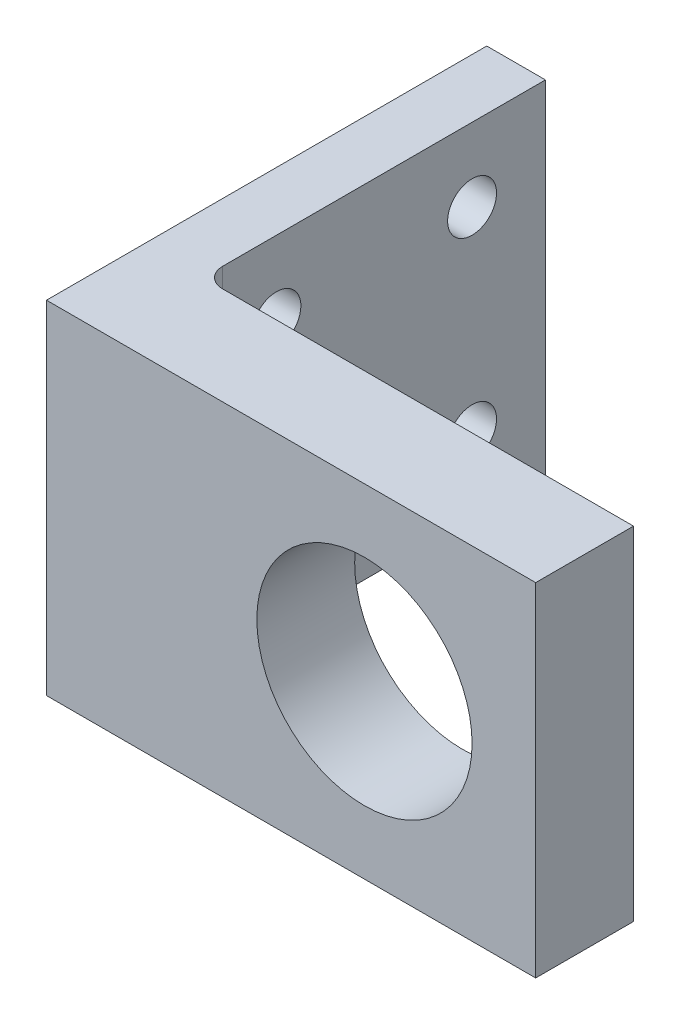
ISO-10303-21;
HEADER;
FILE_DESCRIPTION(('STEP AP214'),'2;1');
FILE_NAME('part.step','',(''),(''),'','','');
FILE_SCHEMA(('AUTOMOTIVE_DESIGN { 1 0 10303 214 1 1 1 1 }'));
ENDSEC;
DATA;
#1=APPLICATION_CONTEXT('core data for automotive mechanical design processes');
#2=APPLICATION_PROTOCOL_DEFINITION('international standard','automotive_design',2000,#1);
#3=PRODUCT_CONTEXT('',#1,'mechanical');
#4=PRODUCT('Part','Part','',(#3));
#5=PRODUCT_RELATED_PRODUCT_CATEGORY('part','',(#4));
#6=PRODUCT_DEFINITION_FORMATION('','',#4);
#7=PRODUCT_DEFINITION_CONTEXT('part definition',#1,'design');
#8=PRODUCT_DEFINITION('design','',#6,#7);
#9=PRODUCT_DEFINITION_SHAPE('','',#8);
#10=(LENGTH_UNIT() NAMED_UNIT(*) SI_UNIT(.MILLI.,.METRE.));
#11=(NAMED_UNIT(*) PLANE_ANGLE_UNIT() SI_UNIT($,.RADIAN.));
#12=(NAMED_UNIT(*) SI_UNIT($,.STERADIAN.) SOLID_ANGLE_UNIT());
#13=UNCERTAINTY_MEASURE_WITH_UNIT(LENGTH_MEASURE(1.E-05),#10,'distance_accuracy_value','');
#14=(GEOMETRIC_REPRESENTATION_CONTEXT(3) GLOBAL_UNCERTAINTY_ASSIGNED_CONTEXT((#13)) GLOBAL_UNIT_ASSIGNED_CONTEXT((#10,
#11,#12)) REPRESENTATION_CONTEXT('',''));
#15=CARTESIAN_POINT('',(0.,0.,0.));
#16=DIRECTION('',(0.,0.,1.));
#17=DIRECTION('',(1.,0.,0.));
#18=AXIS2_PLACEMENT_3D('',#15,#16,#17);
#19=CARTESIAN_POINT('',(7.99999999999999,0.,-2.));
#20=DIRECTION('',(0.,1.,0.));
#21=DIRECTION('',(-1.,0.,0.));
#22=AXIS2_PLACEMENT_3D('',#19,#20,#21);
#23=CYLINDRICAL_SURFACE('',#22,2.);
#24=DIRECTION('',(0.,1.,0.));
#25=VECTOR('',#24,1.);
#26=CARTESIAN_POINT('',(7.99999999999999,0.,0.));
#27=LINE('',#26,#25);
#28=CARTESIAN_POINT('',(7.99999999999999,0.,0.));
#29=VERTEX_POINT('',#28);
#30=CARTESIAN_POINT('',(7.99999999999999,35.,0.));
#31=VERTEX_POINT('',#30);
#32=EDGE_CURVE('E149',#29,#31,#27,.T.);
#33=ORIENTED_EDGE('',*,*,#32,.F.);
#34=CARTESIAN_POINT('',(7.99999999999999,0.,-2.));
#35=DIRECTION('',(0.,1.,0.));
#36=DIRECTION('',(0.,0.,1.));
#37=AXIS2_PLACEMENT_3D('',#34,#35,#36);
#38=CIRCLE('',#37,2.);
#39=CARTESIAN_POINT('',(5.99999999999999,0.,-2.));
#40=VERTEX_POINT('',#39);
#41=EDGE_CURVE('E42',#29,#40,#38,.F.);
#42=ORIENTED_EDGE('',*,*,#41,.T.);
#43=DIRECTION('',(0.,1.,0.));
#44=VECTOR('',#43,1.);
#45=CARTESIAN_POINT('',(5.99999999999999,0.,-2.));
#46=LINE('',#45,#44);
#47=CARTESIAN_POINT('',(5.99999999999999,35.,-2.));
#48=VERTEX_POINT('',#47);
#49=EDGE_CURVE('E113',#48,#40,#46,.F.);
#50=ORIENTED_EDGE('',*,*,#49,.F.);
#51=CARTESIAN_POINT('',(7.99999999999999,35.,-2.));
#52=DIRECTION('',(0.,-1.,0.));
#53=DIRECTION('',(1.,0.,0.));
#54=AXIS2_PLACEMENT_3D('',#51,#52,#53);
#55=CIRCLE('',#54,2.);
#56=EDGE_CURVE('E11',#48,#31,#55,.F.);
#57=ORIENTED_EDGE('',*,*,#56,.T.);
#58=EDGE_LOOP('',(#33,#42,#50,#57));
#59=FACE_BOUND('',#58,.T.);
#60=ADVANCED_FACE('F35',(#59),#23,.F.);
#61=CARTESIAN_POINT('',(0.,0.,10.));
#62=DIRECTION('',(0.,0.,-1.));
#63=DIRECTION('',(-1.,0.,0.));
#64=AXIS2_PLACEMENT_3D('',#61,#62,#63);
#65=PLANE('',#64);
#66=DIRECTION('',(0.,-1.,0.));
#67=VECTOR('',#66,1.);
#68=CARTESIAN_POINT('',(0.,0.,10.));
#69=LINE('',#68,#67);
#70=CARTESIAN_POINT('',(0.,35.,10.));
#71=VERTEX_POINT('',#70);
#72=CARTESIAN_POINT('',(0.,0.,10.));
#73=VERTEX_POINT('',#72);
#74=EDGE_CURVE('E126',#71,#73,#69,.T.);
#75=ORIENTED_EDGE('',*,*,#74,.T.);
#76=DIRECTION('',(1.,0.,0.));
#77=VECTOR('',#76,1.);
#78=CARTESIAN_POINT('',(0.,0.,10.));
#79=LINE('',#78,#77);
#80=CARTESIAN_POINT('',(50.,0.,10.));
#81=VERTEX_POINT('',#80);
#82=EDGE_CURVE('E129',#73,#81,#79,.T.);
#83=ORIENTED_EDGE('',*,*,#82,.T.);
#84=DIRECTION('',(0.,1.,0.));
#85=VECTOR('',#84,1.);
#86=CARTESIAN_POINT('',(50.,0.,10.));
#87=LINE('',#86,#85);
#88=CARTESIAN_POINT('',(50.,35.,10.));
#89=VERTEX_POINT('',#88);
#90=EDGE_CURVE('E132',#81,#89,#87,.T.);
#91=ORIENTED_EDGE('',*,*,#90,.T.);
#92=DIRECTION('',(-1.,0.,0.));
#93=VECTOR('',#92,1.);
#94=CARTESIAN_POINT('',(0.,35.,10.));
#95=LINE('',#94,#93);
#96=EDGE_CURVE('E134',#89,#71,#95,.T.);
#97=ORIENTED_EDGE('',*,*,#96,.T.);
#98=EDGE_LOOP('',(#75,#83,#91,#97));
#99=FACE_BOUND('',#98,.T.);
#100=CARTESIAN_POINT('',(32.5,17.5,10.));
#101=DIRECTION('',(0.,0.,1.));
#102=DIRECTION('',(1.,0.,0.));
#103=AXIS2_PLACEMENT_3D('',#100,#101,#102);
#104=CIRCLE('',#103,11.);
#105=CARTESIAN_POINT('',(43.5,17.5,10.));
#106=VERTEX_POINT('',#105);
#107=EDGE_CURVE('E118',#106,#106,#104,.T.);
#108=ORIENTED_EDGE('',*,*,#107,.F.);
#109=EDGE_LOOP('',(#108));
#110=FACE_BOUND('',#109,.T.);
#111=ADVANCED_FACE('F168',(#99,#110),#65,.F.);
#112=CARTESIAN_POINT('',(0.,0.,0.));
#113=DIRECTION('',(0.,0.,-1.));
#114=DIRECTION('',(-1.,0.,0.));
#115=AXIS2_PLACEMENT_3D('',#112,#113,#114);
#116=PLANE('',#115);
#117=DIRECTION('',(1.,0.,0.));
#118=VECTOR('',#117,1.);
#119=CARTESIAN_POINT('',(0.,0.,0.));
#120=LINE('',#119,#118);
#121=CARTESIAN_POINT('',(50.,0.,0.));
#122=VERTEX_POINT('',#121);
#123=EDGE_CURVE('E124',#29,#122,#120,.T.);
#124=ORIENTED_EDGE('',*,*,#123,.F.);
#125=ORIENTED_EDGE('',*,*,#32,.T.);
#126=DIRECTION('',(-1.,0.,0.));
#127=VECTOR('',#126,1.);
#128=CARTESIAN_POINT('',(0.,35.,0.));
#129=LINE('',#128,#127);
#130=CARTESIAN_POINT('',(50.,35.,0.));
#131=VERTEX_POINT('',#130);
#132=EDGE_CURVE('E130',#131,#31,#129,.T.);
#133=ORIENTED_EDGE('',*,*,#132,.F.);
#134=DIRECTION('',(0.,1.,0.));
#135=VECTOR('',#134,1.);
#136=CARTESIAN_POINT('',(50.,0.,0.));
#137=LINE('',#136,#135);
#138=EDGE_CURVE('E138',#122,#131,#137,.T.);
#139=ORIENTED_EDGE('',*,*,#138,.F.);
#140=EDGE_LOOP('',(#124,#125,#133,#139));
#141=FACE_BOUND('',#140,.T.);
#142=CARTESIAN_POINT('',(32.5,17.5,0.));
#143=DIRECTION('',(0.,0.,1.));
#144=DIRECTION('',(1.,0.,0.));
#145=AXIS2_PLACEMENT_3D('',#142,#143,#144);
#146=CIRCLE('',#145,11.);
#147=CARTESIAN_POINT('',(43.5,17.5,0.));
#148=VERTEX_POINT('',#147);
#149=EDGE_CURVE('E114',#148,#148,#146,.T.);
#150=ORIENTED_EDGE('',*,*,#149,.T.);
#151=EDGE_LOOP('',(#150));
#152=FACE_BOUND('',#151,.T.);
#153=ADVANCED_FACE('F155',(#141,#152),#116,.T.);
#154=CARTESIAN_POINT('',(0.,0.,10.));
#155=DIRECTION('',(1.,0.,0.));
#156=DIRECTION('',(0.,1.,0.));
#157=AXIS2_PLACEMENT_3D('',#154,#155,#156);
#158=PLANE('',#157);
#159=CARTESIAN_POINT('',(0.,27.5,-27.5));
#160=DIRECTION('',(1.,0.,0.));
#161=DIRECTION('',(0.,1.,0.));
#162=AXIS2_PLACEMENT_3D('',#159,#160,#161);
#163=CIRCLE('',#162,2.5);
#164=CARTESIAN_POINT('',(0.,30.,-27.5));
#165=VERTEX_POINT('',#164);
#166=EDGE_CURVE('E110',#165,#165,#163,.T.);
#167=ORIENTED_EDGE('',*,*,#166,.T.);
#168=EDGE_LOOP('',(#167));
#169=FACE_BOUND('',#168,.T.);
#170=CARTESIAN_POINT('',(0.,7.5,-7.5));
#171=DIRECTION('',(1.,0.,0.));
#172=DIRECTION('',(0.,1.,0.));
#173=AXIS2_PLACEMENT_3D('',#170,#171,#172);
#174=CIRCLE('',#173,2.5);
#175=CARTESIAN_POINT('',(0.,10.,-7.5));
#176=VERTEX_POINT('',#175);
#177=EDGE_CURVE('E176',#176,#176,#174,.T.);
#178=ORIENTED_EDGE('',*,*,#177,.T.);
#179=EDGE_LOOP('',(#178));
#180=FACE_BOUND('',#179,.T.);
#181=CARTESIAN_POINT('',(0.,7.5,-27.5));
#182=DIRECTION('',(1.,0.,0.));
#183=DIRECTION('',(0.,1.,0.));
#184=AXIS2_PLACEMENT_3D('',#181,#182,#183);
#185=CIRCLE('',#184,2.5);
#186=CARTESIAN_POINT('',(0.,10.,-27.5));
#187=VERTEX_POINT('',#186);
#188=EDGE_CURVE('E179',#187,#187,#185,.T.);
#189=ORIENTED_EDGE('',*,*,#188,.T.);
#190=EDGE_LOOP('',(#189));
#191=FACE_BOUND('',#190,.T.);
#192=CARTESIAN_POINT('',(0.,27.5,-7.5));
#193=DIRECTION('',(1.,0.,0.));
#194=DIRECTION('',(0.,1.,0.));
#195=AXIS2_PLACEMENT_3D('',#192,#193,#194);
#196=CIRCLE('',#195,2.5);
#197=CARTESIAN_POINT('',(0.,30.,-7.5));
#198=VERTEX_POINT('',#197);
#199=EDGE_CURVE('E182',#198,#198,#196,.T.);
#200=ORIENTED_EDGE('',*,*,#199,.T.);
#201=EDGE_LOOP('',(#200));
#202=FACE_BOUND('',#201,.T.);
#203=DIRECTION('',(0.,0.,-1.));
#204=VECTOR('',#203,1.);
#205=CARTESIAN_POINT('',(0.,35.,10.));
#206=LINE('',#205,#204);
#207=CARTESIAN_POINT('',(0.,35.,-35.));
#208=VERTEX_POINT('',#207);
#209=EDGE_CURVE('E136',#71,#208,#206,.T.);
#210=ORIENTED_EDGE('',*,*,#209,.T.);
#211=DIRECTION('',(0.,1.,0.));
#212=VECTOR('',#211,1.);
#213=CARTESIAN_POINT('',(0.,0.,-35.));
#214=LINE('',#213,#212);
#215=CARTESIAN_POINT('',(0.,0.,-35.));
#216=VERTEX_POINT('',#215);
#217=EDGE_CURVE('E101',#216,#208,#214,.T.);
#218=ORIENTED_EDGE('',*,*,#217,.F.);
#219=DIRECTION('',(0.,0.,-1.));
#220=VECTOR('',#219,1.);
#221=CARTESIAN_POINT('',(0.,0.,10.));
#222=LINE('',#221,#220);
#223=EDGE_CURVE('E97',#73,#216,#222,.T.);
#224=ORIENTED_EDGE('',*,*,#223,.F.);
#225=ORIENTED_EDGE('',*,*,#74,.F.);
#226=EDGE_LOOP('',(#210,#218,#224,#225));
#227=FACE_BOUND('',#226,.T.);
#228=ADVANCED_FACE('F171',(#169,#180,#191,#202,#227),#158,.F.);
#229=CARTESIAN_POINT('',(0.,0.,10.));
#230=DIRECTION('',(0.,1.,0.));
#231=DIRECTION('',(0.,0.,1.));
#232=AXIS2_PLACEMENT_3D('',#229,#230,#231);
#233=PLANE('',#232);
#234=ORIENTED_EDGE('',*,*,#41,.F.);
#235=ORIENTED_EDGE('',*,*,#123,.T.);
#236=DIRECTION('',(0.,0.,-1.));
#237=VECTOR('',#236,1.);
#238=CARTESIAN_POINT('',(50.,0.,10.));
#239=LINE('',#238,#237);
#240=EDGE_CURVE('E145',#81,#122,#239,.T.);
#241=ORIENTED_EDGE('',*,*,#240,.F.);
#242=ORIENTED_EDGE('',*,*,#82,.F.);
#243=ORIENTED_EDGE('',*,*,#223,.T.);
#244=DIRECTION('',(-1.,0.,0.));
#245=VECTOR('',#244,1.);
#246=CARTESIAN_POINT('',(0.,0.,-35.));
#247=LINE('',#246,#245);
#248=CARTESIAN_POINT('',(5.99999999999999,0.,-35.));
#249=VERTEX_POINT('',#248);
#250=EDGE_CURVE('E91',#249,#216,#247,.T.);
#251=ORIENTED_EDGE('',*,*,#250,.F.);
#252=DIRECTION('',(0.,0.,1.));
#253=VECTOR('',#252,1.);
#254=CARTESIAN_POINT('',(5.99999999999999,0.,-35.));
#255=LINE('',#254,#253);
#256=EDGE_CURVE('E95',#249,#40,#255,.T.);
#257=ORIENTED_EDGE('',*,*,#256,.T.);
#258=EDGE_LOOP('',(#234,#235,#241,#242,#243,#251,#257));
#259=FACE_BOUND('',#258,.T.);
#260=ADVANCED_FACE('F93',(#259),#233,.F.);
#261=CARTESIAN_POINT('',(50.,0.,10.));
#262=DIRECTION('',(-1.,0.,0.));
#263=DIRECTION('',(0.,-1.,0.));
#264=AXIS2_PLACEMENT_3D('',#261,#262,#263);
#265=PLANE('',#264);
#266=ORIENTED_EDGE('',*,*,#138,.T.);
#267=DIRECTION('',(0.,0.,-1.));
#268=VECTOR('',#267,1.);
#269=CARTESIAN_POINT('',(50.,35.,10.));
#270=LINE('',#269,#268);
#271=EDGE_CURVE('E142',#89,#131,#270,.T.);
#272=ORIENTED_EDGE('',*,*,#271,.F.);
#273=ORIENTED_EDGE('',*,*,#90,.F.);
#274=ORIENTED_EDGE('',*,*,#240,.T.);
#275=EDGE_LOOP('',(#266,#272,#273,#274));
#276=FACE_BOUND('',#275,.T.);
#277=ADVANCED_FACE('F164',(#276),#265,.F.);
#278=CARTESIAN_POINT('',(0.,35.,10.));
#279=DIRECTION('',(0.,-1.,0.));
#280=DIRECTION('',(1.,0.,0.));
#281=AXIS2_PLACEMENT_3D('',#278,#279,#280);
#282=PLANE('',#281);
#283=ORIENTED_EDGE('',*,*,#132,.T.);
#284=ORIENTED_EDGE('',*,*,#56,.F.);
#285=DIRECTION('',(0.,0.,1.));
#286=VECTOR('',#285,1.);
#287=CARTESIAN_POINT('',(5.99999999999999,35.,-35.));
#288=LINE('',#287,#286);
#289=CARTESIAN_POINT('',(5.99999999999999,35.,-35.));
#290=VERTEX_POINT('',#289);
#291=EDGE_CURVE('E115',#290,#48,#288,.T.);
#292=ORIENTED_EDGE('',*,*,#291,.F.);
#293=DIRECTION('',(1.,0.,0.));
#294=VECTOR('',#293,1.);
#295=CARTESIAN_POINT('',(0.,35.,-35.));
#296=LINE('',#295,#294);
#297=EDGE_CURVE('E107',#208,#290,#296,.T.);
#298=ORIENTED_EDGE('',*,*,#297,.F.);
#299=ORIENTED_EDGE('',*,*,#209,.F.);
#300=ORIENTED_EDGE('',*,*,#96,.F.);
#301=ORIENTED_EDGE('',*,*,#271,.T.);
#302=EDGE_LOOP('',(#283,#284,#292,#298,#299,#300,#301));
#303=FACE_BOUND('',#302,.T.);
#304=ADVANCED_FACE('F158',(#303),#282,.F.);
#305=CARTESIAN_POINT('',(32.5,17.5,10.));
#306=DIRECTION('',(0.,0.,-1.));
#307=DIRECTION('',(-1.,0.,0.));
#308=AXIS2_PLACEMENT_3D('',#305,#306,#307);
#309=CYLINDRICAL_SURFACE('',#308,11.);
#310=ORIENTED_EDGE('',*,*,#107,.T.);
#311=EDGE_LOOP('',(#310));
#312=FACE_BOUND('',#311,.T.);
#313=ORIENTED_EDGE('',*,*,#149,.F.);
#314=EDGE_LOOP('',(#313));
#315=FACE_BOUND('',#314,.T.);
#316=ADVANCED_FACE('F203',(#312,#315),#309,.F.);
#317=CARTESIAN_POINT('',(5.99999999999999,0.,-35.));
#318=DIRECTION('',(-1.,0.,0.));
#319=DIRECTION('',(0.,-1.,0.));
#320=AXIS2_PLACEMENT_3D('',#317,#318,#319);
#321=PLANE('',#320);
#322=CARTESIAN_POINT('',(5.99999999999999,27.5,-27.5));
#323=DIRECTION('',(1.,0.,0.));
#324=DIRECTION('',(0.,-1.,0.));
#325=AXIS2_PLACEMENT_3D('',#322,#323,#324);
#326=CIRCLE('',#325,2.5);
#327=CARTESIAN_POINT('',(5.99999999999999,25.,-27.5));
#328=VERTEX_POINT('',#327);
#329=EDGE_CURVE('E188',#328,#328,#326,.T.);
#330=ORIENTED_EDGE('',*,*,#329,.F.);
#331=EDGE_LOOP('',(#330));
#332=FACE_BOUND('',#331,.T.);
#333=CARTESIAN_POINT('',(5.99999999999999,7.5,-7.5));
#334=DIRECTION('',(1.,0.,0.));
#335=DIRECTION('',(0.,-1.,0.));
#336=AXIS2_PLACEMENT_3D('',#333,#334,#335);
#337=CIRCLE('',#336,2.5);
#338=CARTESIAN_POINT('',(5.99999999999999,5.,-7.5));
#339=VERTEX_POINT('',#338);
#340=EDGE_CURVE('E189',#339,#339,#337,.T.);
#341=ORIENTED_EDGE('',*,*,#340,.F.);
#342=EDGE_LOOP('',(#341));
#343=FACE_BOUND('',#342,.T.);
#344=CARTESIAN_POINT('',(5.99999999999999,7.5,-27.5));
#345=DIRECTION('',(1.,0.,0.));
#346=DIRECTION('',(0.,1.,0.));
#347=AXIS2_PLACEMENT_3D('',#344,#345,#346);
#348=CIRCLE('',#347,2.5);
#349=CARTESIAN_POINT('',(5.99999999999999,10.,-27.5));
#350=VERTEX_POINT('',#349);
#351=EDGE_CURVE('E192',#350,#350,#348,.T.);
#352=ORIENTED_EDGE('',*,*,#351,.F.);
#353=EDGE_LOOP('',(#352));
#354=FACE_BOUND('',#353,.T.);
#355=CARTESIAN_POINT('',(5.99999999999999,27.5,-7.5));
#356=DIRECTION('',(1.,0.,0.));
#357=DIRECTION('',(0.,1.,0.));
#358=AXIS2_PLACEMENT_3D('',#355,#356,#357);
#359=CIRCLE('',#358,2.5);
#360=CARTESIAN_POINT('',(5.99999999999999,30.,-7.5));
#361=VERTEX_POINT('',#360);
#362=EDGE_CURVE('E185',#361,#361,#359,.T.);
#363=ORIENTED_EDGE('',*,*,#362,.F.);
#364=EDGE_LOOP('',(#363));
#365=FACE_BOUND('',#364,.T.);
#366=ORIENTED_EDGE('',*,*,#291,.T.);
#367=ORIENTED_EDGE('',*,*,#49,.T.);
#368=ORIENTED_EDGE('',*,*,#256,.F.);
#369=DIRECTION('',(0.,-1.,0.));
#370=VECTOR('',#369,1.);
#371=CARTESIAN_POINT('',(5.99999999999999,0.,-35.));
#372=LINE('',#371,#370);
#373=EDGE_CURVE('E102',#290,#249,#372,.T.);
#374=ORIENTED_EDGE('',*,*,#373,.F.);
#375=EDGE_LOOP('',(#366,#367,#368,#374));
#376=FACE_BOUND('',#375,.T.);
#377=ADVANCED_FACE('F112',(#332,#343,#354,#365,#376),#321,.F.);
#378=CARTESIAN_POINT('',(0.,0.,-35.));
#379=DIRECTION('',(0.,0.,-1.));
#380=DIRECTION('',(-1.,0.,0.));
#381=AXIS2_PLACEMENT_3D('',#378,#379,#380);
#382=PLANE('',#381);
#383=ORIENTED_EDGE('',*,*,#373,.T.);
#384=ORIENTED_EDGE('',*,*,#250,.T.);
#385=ORIENTED_EDGE('',*,*,#217,.T.);
#386=ORIENTED_EDGE('',*,*,#297,.T.);
#387=EDGE_LOOP('',(#383,#384,#385,#386));
#388=FACE_BOUND('',#387,.T.);
#389=ADVANCED_FACE('F105',(#388),#382,.T.);
#390=CARTESIAN_POINT('',(-4.00000000000001,27.5,-7.5));
#391=DIRECTION('',(1.,0.,0.));
#392=DIRECTION('',(0.,1.,0.));
#393=AXIS2_PLACEMENT_3D('',#390,#391,#392);
#394=CYLINDRICAL_SURFACE('',#393,2.5);
#395=ORIENTED_EDGE('',*,*,#362,.T.);
#396=EDGE_LOOP('',(#395));
#397=FACE_BOUND('',#396,.T.);
#398=ORIENTED_EDGE('',*,*,#199,.F.);
#399=EDGE_LOOP('',(#398));
#400=FACE_BOUND('',#399,.T.);
#401=ADVANCED_FACE('F208',(#397,#400),#394,.F.);
#402=CARTESIAN_POINT('',(-4.00000000000001,7.5,-27.5));
#403=DIRECTION('',(1.,0.,0.));
#404=DIRECTION('',(0.,1.,0.));
#405=AXIS2_PLACEMENT_3D('',#402,#403,#404);
#406=CYLINDRICAL_SURFACE('',#405,2.5);
#407=ORIENTED_EDGE('',*,*,#351,.T.);
#408=EDGE_LOOP('',(#407));
#409=FACE_BOUND('',#408,.T.);
#410=ORIENTED_EDGE('',*,*,#188,.F.);
#411=EDGE_LOOP('',(#410));
#412=FACE_BOUND('',#411,.T.);
#413=ADVANCED_FACE('F198',(#409,#412),#406,.F.);
#414=CARTESIAN_POINT('',(-4.00000000000001,7.5,-7.5));
#415=DIRECTION('',(1.,0.,0.));
#416=DIRECTION('',(0.,1.,0.));
#417=AXIS2_PLACEMENT_3D('',#414,#415,#416);
#418=CYLINDRICAL_SURFACE('',#417,2.5);
#419=ORIENTED_EDGE('',*,*,#340,.T.);
#420=EDGE_LOOP('',(#419));
#421=FACE_BOUND('',#420,.T.);
#422=ORIENTED_EDGE('',*,*,#177,.F.);
#423=EDGE_LOOP('',(#422));
#424=FACE_BOUND('',#423,.T.);
#425=ADVANCED_FACE('F269',(#421,#424),#418,.F.);
#426=CARTESIAN_POINT('',(-4.00000000000001,27.5,-27.5));
#427=DIRECTION('',(1.,0.,0.));
#428=DIRECTION('',(0.,1.,0.));
#429=AXIS2_PLACEMENT_3D('',#426,#427,#428);
#430=CYLINDRICAL_SURFACE('',#429,2.5);
#431=ORIENTED_EDGE('',*,*,#329,.T.);
#432=EDGE_LOOP('',(#431));
#433=FACE_BOUND('',#432,.T.);
#434=ORIENTED_EDGE('',*,*,#166,.F.);
#435=EDGE_LOOP('',(#434));
#436=FACE_BOUND('',#435,.T.);
#437=ADVANCED_FACE('F276',(#433,#436),#430,.F.);
#438=CLOSED_SHELL('',(#60,#111,#153,#228,#260,#277,#304,#316,#377,#389,#401,#413,#425,#437));
#439=MANIFOLD_SOLID_BREP('B2',#438);
#440=ADVANCED_BREP_SHAPE_REPRESENTATION('',(#18,#439),#14);
#441=SHAPE_DEFINITION_REPRESENTATION(#9,#440);
ENDSEC;
END-ISO-10303-21;
